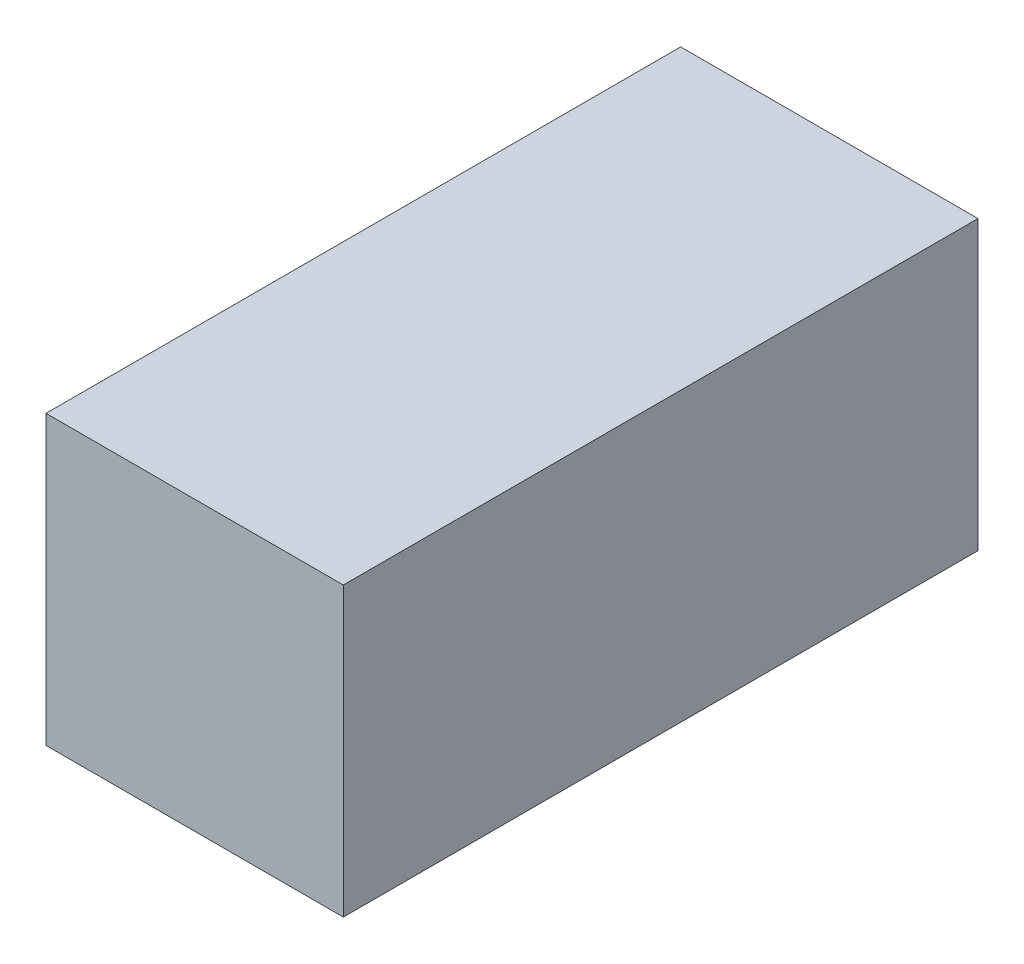
ISO-10303-21;
HEADER;
FILE_DESCRIPTION(('STEP AP214'),'2;1');
FILE_NAME('part.step','',(''),(''),'','','');
FILE_SCHEMA(('AUTOMOTIVE_DESIGN { 1 0 10303 214 1 1 1 1 }'));
ENDSEC;
DATA;
#1=APPLICATION_CONTEXT('core data for automotive mechanical design processes');
#2=APPLICATION_PROTOCOL_DEFINITION('international standard','automotive_design',2000,#1);
#3=PRODUCT_CONTEXT('',#1,'mechanical');
#4=PRODUCT('Part','Part','',(#3));
#5=PRODUCT_RELATED_PRODUCT_CATEGORY('part','',(#4));
#6=PRODUCT_DEFINITION_FORMATION('','',#4);
#7=PRODUCT_DEFINITION_CONTEXT('part definition',#1,'design');
#8=PRODUCT_DEFINITION('design','',#6,#7);
#9=PRODUCT_DEFINITION_SHAPE('','',#8);
#10=(LENGTH_UNIT() NAMED_UNIT(*) SI_UNIT(.MILLI.,.METRE.));
#11=(NAMED_UNIT(*) PLANE_ANGLE_UNIT() SI_UNIT($,.RADIAN.));
#12=(NAMED_UNIT(*) SI_UNIT($,.STERADIAN.) SOLID_ANGLE_UNIT());
#13=UNCERTAINTY_MEASURE_WITH_UNIT(LENGTH_MEASURE(1.E-05),#10,'distance_accuracy_value','');
#14=(GEOMETRIC_REPRESENTATION_CONTEXT(3) GLOBAL_UNCERTAINTY_ASSIGNED_CONTEXT((#13)) GLOBAL_UNIT_ASSIGNED_CONTEXT((#10,
#11,#12)) REPRESENTATION_CONTEXT('',''));
#15=CARTESIAN_POINT('',(0.,0.,0.));
#16=DIRECTION('',(0.,0.,1.));
#17=DIRECTION('',(1.,0.,0.));
#18=AXIS2_PLACEMENT_3D('',#15,#16,#17);
#19=CARTESIAN_POINT('',(-12.25,11.85,52.3));
#20=DIRECTION('',(1.,0.,0.));
#21=DIRECTION('',(0.,1.,0.));
#22=AXIS2_PLACEMENT_3D('',#19,#20,#21);
#23=PLANE('',#22);
#24=DIRECTION('',(0.,-1.,0.));
#25=VECTOR('',#24,1.);
#26=CARTESIAN_POINT('',(-12.25,11.85,0.));
#27=LINE('',#26,#25);
#28=CARTESIAN_POINT('',(-12.25,11.85,0.));
#29=VERTEX_POINT('',#28);
#30=CARTESIAN_POINT('',(-12.25,-11.85,0.));
#31=VERTEX_POINT('',#30);
#32=EDGE_CURVE('E94',#29,#31,#27,.T.);
#33=ORIENTED_EDGE('',*,*,#32,.T.);
#34=DIRECTION('',(0.,0.,-1.));
#35=VECTOR('',#34,1.);
#36=CARTESIAN_POINT('',(-12.25,-11.85,52.3));
#37=LINE('',#36,#35);
#38=CARTESIAN_POINT('',(-12.25,-11.85,52.3));
#39=VERTEX_POINT('',#38);
#40=EDGE_CURVE('E11',#39,#31,#37,.T.);
#41=ORIENTED_EDGE('',*,*,#40,.F.);
#42=DIRECTION('',(0.,-1.,0.));
#43=VECTOR('',#42,1.);
#44=CARTESIAN_POINT('',(-12.25,11.85,52.3));
#45=LINE('',#44,#43);
#46=CARTESIAN_POINT('',(-12.25,11.85,52.3));
#47=VERTEX_POINT('',#46);
#48=EDGE_CURVE('E82',#47,#39,#45,.T.);
#49=ORIENTED_EDGE('',*,*,#48,.F.);
#50=DIRECTION('',(0.,0.,-1.));
#51=VECTOR('',#50,1.);
#52=CARTESIAN_POINT('',(-12.25,11.85,52.3));
#53=LINE('',#52,#51);
#54=EDGE_CURVE('E90',#47,#29,#53,.T.);
#55=ORIENTED_EDGE('',*,*,#54,.T.);
#56=EDGE_LOOP('',(#33,#41,#49,#55));
#57=FACE_BOUND('',#56,.T.);
#58=ADVANCED_FACE('F31',(#57),#23,.F.);
#59=CARTESIAN_POINT('',(-12.25,-11.85,52.3));
#60=DIRECTION('',(0.,1.,0.));
#61=DIRECTION('',(0.,0.,1.));
#62=AXIS2_PLACEMENT_3D('',#59,#60,#61);
#63=PLANE('',#62);
#64=DIRECTION('',(1.,0.,0.));
#65=VECTOR('',#64,1.);
#66=CARTESIAN_POINT('',(-12.25,-11.85,0.));
#67=LINE('',#66,#65);
#68=CARTESIAN_POINT('',(12.25,-11.85,0.));
#69=VERTEX_POINT('',#68);
#70=EDGE_CURVE('E86',#31,#69,#67,.T.);
#71=ORIENTED_EDGE('',*,*,#70,.T.);
#72=DIRECTION('',(0.,0.,-1.));
#73=VECTOR('',#72,1.);
#74=CARTESIAN_POINT('',(12.25,-11.85,52.3));
#75=LINE('',#74,#73);
#76=CARTESIAN_POINT('',(12.25,-11.85,52.3));
#77=VERTEX_POINT('',#76);
#78=EDGE_CURVE('E39',#77,#69,#75,.T.);
#79=ORIENTED_EDGE('',*,*,#78,.F.);
#80=DIRECTION('',(1.,0.,0.));
#81=VECTOR('',#80,1.);
#82=CARTESIAN_POINT('',(-12.25,-11.85,52.3));
#83=LINE('',#82,#81);
#84=EDGE_CURVE('E77',#39,#77,#83,.T.);
#85=ORIENTED_EDGE('',*,*,#84,.F.);
#86=ORIENTED_EDGE('',*,*,#40,.T.);
#87=EDGE_LOOP('',(#71,#79,#85,#86));
#88=FACE_BOUND('',#87,.T.);
#89=ADVANCED_FACE('F85',(#88),#63,.F.);
#90=CARTESIAN_POINT('',(12.25,11.85,52.3));
#91=DIRECTION('',(-1.,0.,0.));
#92=DIRECTION('',(0.,-1.,0.));
#93=AXIS2_PLACEMENT_3D('',#90,#91,#92);
#94=PLANE('',#93);
#95=DIRECTION('',(0.,1.,0.));
#96=VECTOR('',#95,1.);
#97=CARTESIAN_POINT('',(12.25,11.85,0.));
#98=LINE('',#97,#96);
#99=CARTESIAN_POINT('',(12.25,11.85,0.));
#100=VERTEX_POINT('',#99);
#101=EDGE_CURVE('E64',#69,#100,#98,.T.);
#102=ORIENTED_EDGE('',*,*,#101,.T.);
#103=DIRECTION('',(0.,0.,-1.));
#104=VECTOR('',#103,1.);
#105=CARTESIAN_POINT('',(12.25,11.85,52.3));
#106=LINE('',#105,#104);
#107=CARTESIAN_POINT('',(12.25,11.85,52.3));
#108=VERTEX_POINT('',#107);
#109=EDGE_CURVE('E87',#108,#100,#106,.T.);
#110=ORIENTED_EDGE('',*,*,#109,.F.);
#111=DIRECTION('',(0.,1.,0.));
#112=VECTOR('',#111,1.);
#113=CARTESIAN_POINT('',(12.25,11.85,52.3));
#114=LINE('',#113,#112);
#115=EDGE_CURVE('E80',#77,#108,#114,.T.);
#116=ORIENTED_EDGE('',*,*,#115,.F.);
#117=ORIENTED_EDGE('',*,*,#78,.T.);
#118=EDGE_LOOP('',(#102,#110,#116,#117));
#119=FACE_BOUND('',#118,.T.);
#120=ADVANCED_FACE('F88',(#119),#94,.F.);
#121=CARTESIAN_POINT('',(-12.25,11.85,52.3));
#122=DIRECTION('',(0.,-1.,0.));
#123=DIRECTION('',(0.,0.,-1.));
#124=AXIS2_PLACEMENT_3D('',#121,#122,#123);
#125=PLANE('',#124);
#126=DIRECTION('',(-1.,0.,0.));
#127=VECTOR('',#126,1.);
#128=CARTESIAN_POINT('',(-12.25,11.85,0.));
#129=LINE('',#128,#127);
#130=EDGE_CURVE('E70',#100,#29,#129,.T.);
#131=ORIENTED_EDGE('',*,*,#130,.T.);
#132=ORIENTED_EDGE('',*,*,#54,.F.);
#133=DIRECTION('',(-1.,0.,0.));
#134=VECTOR('',#133,1.);
#135=CARTESIAN_POINT('',(-12.25,11.85,52.3));
#136=LINE('',#135,#134);
#137=EDGE_CURVE('E47',#108,#47,#136,.T.);
#138=ORIENTED_EDGE('',*,*,#137,.F.);
#139=ORIENTED_EDGE('',*,*,#109,.T.);
#140=EDGE_LOOP('',(#131,#132,#138,#139));
#141=FACE_BOUND('',#140,.T.);
#142=ADVANCED_FACE('F101',(#141),#125,.F.);
#143=CARTESIAN_POINT('',(-12.25,-11.85,52.3));
#144=DIRECTION('',(0.,0.,1.));
#145=DIRECTION('',(1.,0.,0.));
#146=AXIS2_PLACEMENT_3D('',#143,#144,#145);
#147=PLANE('',#146);
#148=ORIENTED_EDGE('',*,*,#48,.T.);
#149=ORIENTED_EDGE('',*,*,#84,.T.);
#150=ORIENTED_EDGE('',*,*,#115,.T.);
#151=ORIENTED_EDGE('',*,*,#137,.T.);
#152=EDGE_LOOP('',(#148,#149,#150,#151));
#153=FACE_BOUND('',#152,.T.);
#154=ADVANCED_FACE('F78',(#153),#147,.T.);
#155=CARTESIAN_POINT('',(-12.25,-11.85,0.));
#156=DIRECTION('',(0.,0.,1.));
#157=DIRECTION('',(1.,0.,0.));
#158=AXIS2_PLACEMENT_3D('',#155,#156,#157);
#159=PLANE('',#158);
#160=ORIENTED_EDGE('',*,*,#32,.F.);
#161=ORIENTED_EDGE('',*,*,#130,.F.);
#162=ORIENTED_EDGE('',*,*,#101,.F.);
#163=ORIENTED_EDGE('',*,*,#70,.F.);
#164=EDGE_LOOP('',(#160,#161,#162,#163));
#165=FACE_BOUND('',#164,.T.);
#166=ADVANCED_FACE('F104',(#165),#159,.F.);
#167=CLOSED_SHELL('',(#58,#89,#120,#142,#154,#166));
#168=MANIFOLD_SOLID_BREP('B2',#167);
#169=ADVANCED_BREP_SHAPE_REPRESENTATION('',(#18,#168),#14);
#170=SHAPE_DEFINITION_REPRESENTATION(#9,#169);
ENDSEC;
END-ISO-10303-21;
